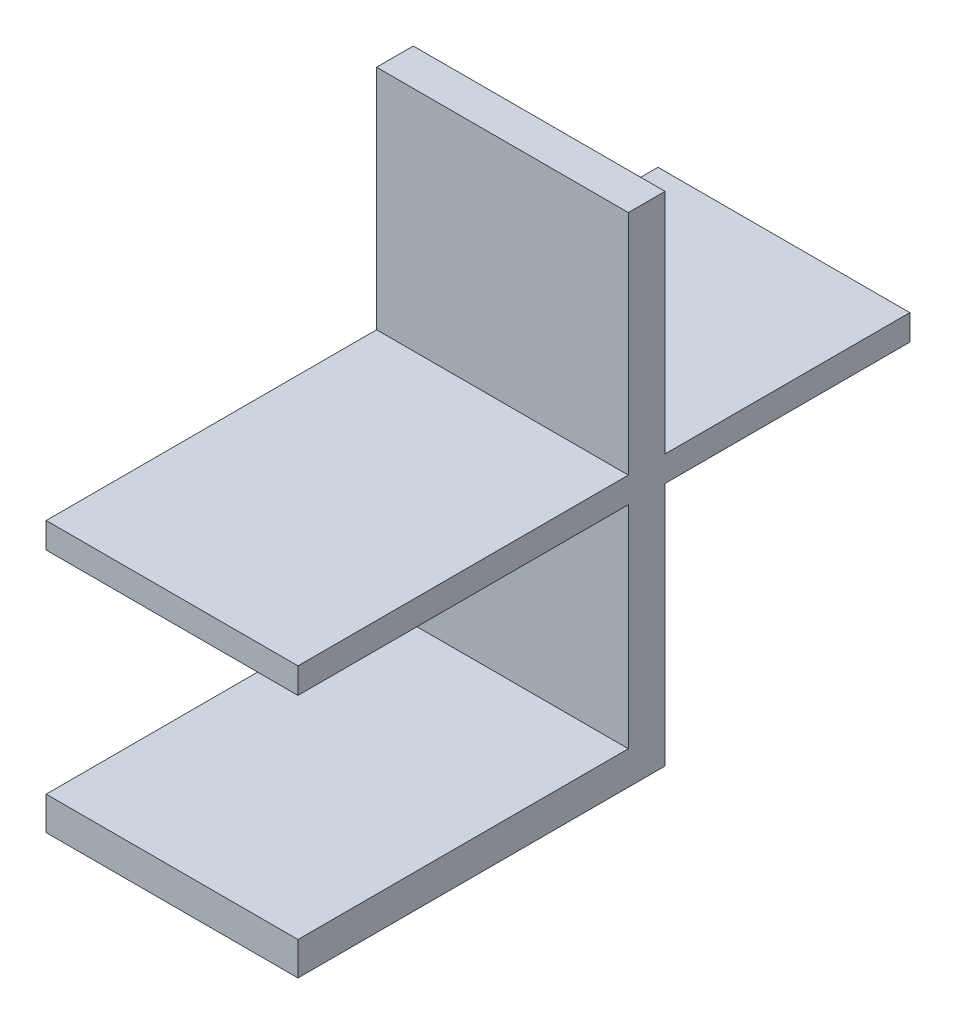
ISO-10303-21;
HEADER;
FILE_DESCRIPTION(('STEP AP214'),'2;1');
FILE_NAME('part.step','',(''),(''),'','','');
FILE_SCHEMA(('AUTOMOTIVE_DESIGN { 1 0 10303 214 1 1 1 1 }'));
ENDSEC;
DATA;
#1=APPLICATION_CONTEXT('core data for automotive mechanical design processes');
#2=APPLICATION_PROTOCOL_DEFINITION('international standard','automotive_design',2000,#1);
#3=PRODUCT_CONTEXT('',#1,'mechanical');
#4=PRODUCT('Part','Part','',(#3));
#5=PRODUCT_RELATED_PRODUCT_CATEGORY('part','',(#4));
#6=PRODUCT_DEFINITION_FORMATION('','',#4);
#7=PRODUCT_DEFINITION_CONTEXT('part definition',#1,'design');
#8=PRODUCT_DEFINITION('design','',#6,#7);
#9=PRODUCT_DEFINITION_SHAPE('','',#8);
#10=(LENGTH_UNIT() NAMED_UNIT(*) SI_UNIT(.MILLI.,.METRE.));
#11=(NAMED_UNIT(*) PLANE_ANGLE_UNIT() SI_UNIT($,.RADIAN.));
#12=(NAMED_UNIT(*) SI_UNIT($,.STERADIAN.) SOLID_ANGLE_UNIT());
#13=UNCERTAINTY_MEASURE_WITH_UNIT(LENGTH_MEASURE(1.E-05),#10,'distance_accuracy_value','');
#14=(GEOMETRIC_REPRESENTATION_CONTEXT(3) GLOBAL_UNCERTAINTY_ASSIGNED_CONTEXT((#13)) GLOBAL_UNIT_ASSIGNED_CONTEXT((#10,
#11,#12)) REPRESENTATION_CONTEXT('',''));
#15=CARTESIAN_POINT('',(0.,0.,0.));
#16=DIRECTION('',(0.,0.,1.));
#17=DIRECTION('',(1.,0.,0.));
#18=AXIS2_PLACEMENT_3D('',#15,#16,#17);
#19=CARTESIAN_POINT('',(90.3712111208343,5.53566649843251,198.567247699072));
#20=DIRECTION('',(0.,0.,-1.));
#21=DIRECTION('',(-1.,0.,0.));
#22=AXIS2_PLACEMENT_3D('',#19,#20,#21);
#23=PLANE('',#22);
#24=DIRECTION('',(-1.,0.,0.));
#25=VECTOR('',#24,1.);
#26=CARTESIAN_POINT('',(110.947514771984,8.25912695731414,198.567247699072));
#27=LINE('',#26,#25);
#28=CARTESIAN_POINT('',(110.947514771984,8.25912695731414,198.567247699072));
#29=VERTEX_POINT('',#28);
#30=CARTESIAN_POINT('',(90.3712111208343,8.25912695731414,198.567247699072));
#31=VERTEX_POINT('',#30);
#32=EDGE_CURVE('E154',#29,#31,#27,.T.);
#33=ORIENTED_EDGE('',*,*,#32,.F.);
#34=DIRECTION('',(0.,1.,0.));
#35=VECTOR('',#34,1.);
#36=CARTESIAN_POINT('',(110.947514771984,5.53566649843251,198.567247699072));
#37=LINE('',#36,#35);
#38=CARTESIAN_POINT('',(110.947514771984,25.5356664984325,198.567247699072));
#39=VERTEX_POINT('',#38);
#40=EDGE_CURVE('E159',#29,#39,#37,.T.);
#41=ORIENTED_EDGE('',*,*,#40,.T.);
#42=DIRECTION('',(-1.,0.,0.));
#43=VECTOR('',#42,1.);
#44=CARTESIAN_POINT('',(90.3712111208343,25.5356664984325,198.567247699072));
#45=LINE('',#44,#43);
#46=CARTESIAN_POINT('',(90.3712111208343,25.5356664984325,198.567247699072));
#47=VERTEX_POINT('',#46);
#48=EDGE_CURVE('E161',#39,#47,#45,.T.);
#49=ORIENTED_EDGE('',*,*,#48,.T.);
#50=DIRECTION('',(0.,1.,0.));
#51=VECTOR('',#50,1.);
#52=CARTESIAN_POINT('',(90.3712111208343,5.53566649843251,198.567247699072));
#53=LINE('',#52,#51);
#54=EDGE_CURVE('E49',#31,#47,#53,.T.);
#55=ORIENTED_EDGE('',*,*,#54,.F.);
#56=EDGE_LOOP('',(#33,#41,#49,#55));
#57=FACE_BOUND('',#56,.T.);
#58=ADVANCED_FACE('F32',(#57),#23,.F.);
#59=CARTESIAN_POINT('',(90.3712111208343,25.5356664984325,175.567247699072));
#60=DIRECTION('',(0.,-1.,0.));
#61=DIRECTION('',(0.,0.,-1.));
#62=AXIS2_PLACEMENT_3D('',#59,#60,#61);
#63=PLANE('',#62);
#64=ORIENTED_EDGE('',*,*,#48,.F.);
#65=DIRECTION('',(0.,0.,1.));
#66=VECTOR('',#65,1.);
#67=CARTESIAN_POINT('',(110.947514771984,25.5356664984325,175.567247699072));
#68=LINE('',#67,#66);
#69=CARTESIAN_POINT('',(110.947514771984,25.5356664984325,225.567247699072));
#70=VERTEX_POINT('',#69);
#71=EDGE_CURVE('E41',#39,#70,#68,.T.);
#72=ORIENTED_EDGE('',*,*,#71,.T.);
#73=DIRECTION('',(1.,0.,0.));
#74=VECTOR('',#73,1.);
#75=CARTESIAN_POINT('',(90.3712111208343,25.5356664984325,225.567247699072));
#76=LINE('',#75,#74);
#77=CARTESIAN_POINT('',(90.3712111208343,25.5356664984325,225.567247699072));
#78=VERTEX_POINT('',#77);
#79=EDGE_CURVE('E219',#78,#70,#76,.T.);
#80=ORIENTED_EDGE('',*,*,#79,.F.);
#81=DIRECTION('',(0.,0.,1.));
#82=VECTOR('',#81,1.);
#83=CARTESIAN_POINT('',(90.3712111208343,25.5356664984325,175.567247699072));
#84=LINE('',#83,#82);
#85=EDGE_CURVE('E236',#47,#78,#84,.T.);
#86=ORIENTED_EDGE('',*,*,#85,.F.);
#87=EDGE_LOOP('',(#64,#72,#80,#86));
#88=FACE_BOUND('',#87,.T.);
#89=ADVANCED_FACE('F254',(#88),#63,.T.);
#90=CARTESIAN_POINT('',(110.947514771984,27.626098268138,175.567247699072));
#91=DIRECTION('',(0.,1.,0.));
#92=DIRECTION('',(0.,0.,1.));
#93=AXIS2_PLACEMENT_3D('',#90,#91,#92);
#94=PLANE('',#93);
#95=DIRECTION('',(0.,0.,1.));
#96=VECTOR('',#95,1.);
#97=CARTESIAN_POINT('',(90.3712111208343,27.626098268138,175.567247699072));
#98=LINE('',#97,#96);
#99=CARTESIAN_POINT('',(90.3712111208343,27.626098268138,175.567247699072));
#100=VERTEX_POINT('',#99);
#101=CARTESIAN_POINT('',(90.3712111208343,27.626098268138,195.567247699072));
#102=VERTEX_POINT('',#101);
#103=EDGE_CURVE('E237',#100,#102,#98,.T.);
#104=ORIENTED_EDGE('',*,*,#103,.T.);
#105=DIRECTION('',(1.,0.,0.));
#106=VECTOR('',#105,1.);
#107=CARTESIAN_POINT('',(110.947514771984,27.626098268138,195.567247699072));
#108=LINE('',#107,#106);
#109=CARTESIAN_POINT('',(110.947514771984,27.626098268138,195.567247699072));
#110=VERTEX_POINT('',#109);
#111=EDGE_CURVE('E188',#102,#110,#108,.T.);
#112=ORIENTED_EDGE('',*,*,#111,.T.);
#113=DIRECTION('',(0.,0.,1.));
#114=VECTOR('',#113,1.);
#115=CARTESIAN_POINT('',(110.947514771984,27.626098268138,175.567247699072));
#116=LINE('',#115,#114);
#117=CARTESIAN_POINT('',(110.947514771984,27.626098268138,175.567247699072));
#118=VERTEX_POINT('',#117);
#119=EDGE_CURVE('E36',#118,#110,#116,.T.);
#120=ORIENTED_EDGE('',*,*,#119,.F.);
#121=DIRECTION('',(-1.,0.,0.));
#122=VECTOR('',#121,1.);
#123=CARTESIAN_POINT('',(110.947514771984,27.626098268138,175.567247699072));
#124=LINE('',#123,#122);
#125=EDGE_CURVE('E225',#118,#100,#124,.T.);
#126=ORIENTED_EDGE('',*,*,#125,.T.);
#127=EDGE_LOOP('',(#104,#112,#120,#126));
#128=FACE_BOUND('',#127,.T.);
#129=ADVANCED_FACE('F272',(#128),#94,.T.);
#130=CARTESIAN_POINT('',(110.947514771984,27.626098268138,175.567247699072));
#131=DIRECTION('',(1.,0.,0.));
#132=DIRECTION('',(0.,0.,-1.));
#133=AXIS2_PLACEMENT_3D('',#130,#131,#132);
#134=PLANE('',#133);
#135=ORIENTED_EDGE('',*,*,#119,.T.);
#136=DIRECTION('',(0.,1.,0.));
#137=VECTOR('',#136,1.);
#138=CARTESIAN_POINT('',(110.947514771984,27.626098268138,195.567247699072));
#139=LINE('',#138,#137);
#140=CARTESIAN_POINT('',(110.947514771984,46.2079762310838,195.567247699072));
#141=VERTEX_POINT('',#140);
#142=EDGE_CURVE('E183',#110,#141,#139,.T.);
#143=ORIENTED_EDGE('',*,*,#142,.T.);
#144=DIRECTION('',(0.,0.,-1.));
#145=VECTOR('',#144,1.);
#146=CARTESIAN_POINT('',(110.947514771984,46.2079762310838,198.567247699072));
#147=LINE('',#146,#145);
#148=CARTESIAN_POINT('',(110.947514771984,46.2079762310838,198.567247699072));
#149=VERTEX_POINT('',#148);
#150=EDGE_CURVE('E207',#149,#141,#147,.T.);
#151=ORIENTED_EDGE('',*,*,#150,.F.);
#152=DIRECTION('',(0.,1.,0.));
#153=VECTOR('',#152,1.);
#154=CARTESIAN_POINT('',(110.947514771984,27.626098268138,198.567247699072));
#155=LINE('',#154,#153);
#156=CARTESIAN_POINT('',(110.947514771984,27.626098268138,198.567247699072));
#157=VERTEX_POINT('',#156);
#158=EDGE_CURVE('E184',#157,#149,#155,.T.);
#159=ORIENTED_EDGE('',*,*,#158,.F.);
#160=CARTESIAN_POINT('',(110.947514771984,27.626098268138,225.567247699072));
#161=VERTEX_POINT('',#160);
#162=EDGE_CURVE('E233',#157,#161,#116,.T.);
#163=ORIENTED_EDGE('',*,*,#162,.T.);
#164=DIRECTION('',(0.,1.,0.));
#165=VECTOR('',#164,1.);
#166=CARTESIAN_POINT('',(110.947514771984,27.626098268138,225.567247699072));
#167=LINE('',#166,#165);
#168=EDGE_CURVE('E210',#70,#161,#167,.T.);
#169=ORIENTED_EDGE('',*,*,#168,.F.);
#170=ORIENTED_EDGE('',*,*,#71,.F.);
#171=ORIENTED_EDGE('',*,*,#40,.F.);
#172=DIRECTION('',(0.,0.,-1.));
#173=VECTOR('',#172,1.);
#174=CARTESIAN_POINT('',(110.947514771984,8.25912695731414,225.567247699072));
#175=LINE('',#174,#173);
#176=CARTESIAN_POINT('',(110.947514771984,8.25912695731414,225.567247699072));
#177=VERTEX_POINT('',#176);
#178=EDGE_CURVE('E138',#177,#29,#175,.T.);
#179=ORIENTED_EDGE('',*,*,#178,.F.);
#180=DIRECTION('',(0.,1.,0.));
#181=VECTOR('',#180,1.);
#182=CARTESIAN_POINT('',(110.947514771984,5.53566649843251,225.567247699072));
#183=LINE('',#182,#181);
#184=CARTESIAN_POINT('',(110.947514771984,5.53566649843251,225.567247699072));
#185=VERTEX_POINT('',#184);
#186=EDGE_CURVE('E145',#185,#177,#183,.T.);
#187=ORIENTED_EDGE('',*,*,#186,.F.);
#188=DIRECTION('',(0.,0.,1.));
#189=VECTOR('',#188,1.);
#190=CARTESIAN_POINT('',(110.947514771984,5.53566649843251,198.567247699072));
#191=LINE('',#190,#189);
#192=CARTESIAN_POINT('',(110.947514771984,5.53566649843251,195.567247699072));
#193=VERTEX_POINT('',#192);
#194=EDGE_CURVE('E171',#193,#185,#191,.T.);
#195=ORIENTED_EDGE('',*,*,#194,.F.);
#196=DIRECTION('',(0.,1.,0.));
#197=VECTOR('',#196,1.);
#198=CARTESIAN_POINT('',(110.947514771984,5.53566649843251,195.567247699072));
#199=LINE('',#198,#197);
#200=CARTESIAN_POINT('',(110.947514771984,25.5356664984325,195.567247699072));
#201=VERTEX_POINT('',#200);
#202=EDGE_CURVE('E177',#193,#201,#199,.T.);
#203=ORIENTED_EDGE('',*,*,#202,.T.);
#204=CARTESIAN_POINT('',(110.947514771984,25.5356664984325,175.567247699072));
#205=VERTEX_POINT('',#204);
#206=EDGE_CURVE('E11',#205,#201,#68,.T.);
#207=ORIENTED_EDGE('',*,*,#206,.F.);
#208=DIRECTION('',(0.,1.,0.));
#209=VECTOR('',#208,1.);
#210=CARTESIAN_POINT('',(110.947514771984,27.626098268138,175.567247699072));
#211=LINE('',#210,#209);
#212=EDGE_CURVE('E222',#205,#118,#211,.T.);
#213=ORIENTED_EDGE('',*,*,#212,.T.);
#214=EDGE_LOOP('',(#135,#143,#151,#159,#163,#169,#170,#171,#179,#187,#195,#203,#207,#213));
#215=FACE_BOUND('',#214,.T.);
#216=ADVANCED_FACE('F34',(#215),#134,.T.);
#217=DIRECTION('',(1.,0.,0.));
#218=VECTOR('',#217,1.);
#219=CARTESIAN_POINT('',(110.947514771984,25.5356664984325,195.567247699072));
#220=LINE('',#219,#218);
#221=CARTESIAN_POINT('',(90.3712111208343,25.5356664984325,195.567247699072));
#222=VERTEX_POINT('',#221);
#223=EDGE_CURVE('E56',#222,#201,#220,.T.);
#224=ORIENTED_EDGE('',*,*,#223,.F.);
#225=CARTESIAN_POINT('',(90.3712111208343,25.5356664984325,175.567247699072));
#226=VERTEX_POINT('',#225);
#227=EDGE_CURVE('E235',#226,#222,#84,.T.);
#228=ORIENTED_EDGE('',*,*,#227,.F.);
#229=DIRECTION('',(1.,0.,0.));
#230=VECTOR('',#229,1.);
#231=CARTESIAN_POINT('',(90.3712111208343,25.5356664984325,175.567247699072));
#232=LINE('',#231,#230);
#233=EDGE_CURVE('E231',#226,#205,#232,.T.);
#234=ORIENTED_EDGE('',*,*,#233,.T.);
#235=ORIENTED_EDGE('',*,*,#206,.T.);
#236=EDGE_LOOP('',(#224,#228,#234,#235));
#237=FACE_BOUND('',#236,.T.);
#238=ADVANCED_FACE('F268',(#237),#63,.T.);
#239=CARTESIAN_POINT('',(90.3712111208343,27.626098268138,175.567247699072));
#240=DIRECTION('',(-1.,0.,0.));
#241=DIRECTION('',(0.,0.,1.));
#242=AXIS2_PLACEMENT_3D('',#239,#240,#241);
#243=PLANE('',#242);
#244=ORIENTED_EDGE('',*,*,#227,.T.);
#245=DIRECTION('',(0.,1.,0.));
#246=VECTOR('',#245,1.);
#247=CARTESIAN_POINT('',(90.3712111208343,5.53566649843251,195.567247699072));
#248=LINE('',#247,#246);
#249=CARTESIAN_POINT('',(90.3712111208343,5.53566649843251,195.567247699072));
#250=VERTEX_POINT('',#249);
#251=EDGE_CURVE('E180',#250,#222,#248,.T.);
#252=ORIENTED_EDGE('',*,*,#251,.F.);
#253=DIRECTION('',(0.,0.,-1.));
#254=VECTOR('',#253,1.);
#255=CARTESIAN_POINT('',(90.3712111208343,5.53566649843251,198.567247699072));
#256=LINE('',#255,#254);
#257=CARTESIAN_POINT('',(90.3712111208343,5.53566649843251,225.567247699072));
#258=VERTEX_POINT('',#257);
#259=EDGE_CURVE('E166',#258,#250,#256,.T.);
#260=ORIENTED_EDGE('',*,*,#259,.F.);
#261=DIRECTION('',(0.,-1.,0.));
#262=VECTOR('',#261,1.);
#263=CARTESIAN_POINT('',(90.3712111208343,5.53566649843251,225.567247699072));
#264=LINE('',#263,#262);
#265=CARTESIAN_POINT('',(90.3712111208343,8.25912695731414,225.567247699072));
#266=VERTEX_POINT('',#265);
#267=EDGE_CURVE('E144',#266,#258,#264,.T.);
#268=ORIENTED_EDGE('',*,*,#267,.F.);
#269=DIRECTION('',(0.,0.,-1.));
#270=VECTOR('',#269,1.);
#271=CARTESIAN_POINT('',(90.3712111208343,8.25912695731414,225.567247699072));
#272=LINE('',#271,#270);
#273=EDGE_CURVE('E140',#266,#31,#272,.T.);
#274=ORIENTED_EDGE('',*,*,#273,.T.);
#275=ORIENTED_EDGE('',*,*,#54,.T.);
#276=ORIENTED_EDGE('',*,*,#85,.T.);
#277=DIRECTION('',(0.,-1.,0.));
#278=VECTOR('',#277,1.);
#279=CARTESIAN_POINT('',(90.3712111208343,27.626098268138,225.567247699072));
#280=LINE('',#279,#278);
#281=CARTESIAN_POINT('',(90.3712111208343,27.626098268138,225.567247699072));
#282=VERTEX_POINT('',#281);
#283=EDGE_CURVE('E216',#282,#78,#280,.T.);
#284=ORIENTED_EDGE('',*,*,#283,.F.);
#285=CARTESIAN_POINT('',(90.3712111208343,27.626098268138,198.567247699072));
#286=VERTEX_POINT('',#285);
#287=EDGE_CURVE('E238',#286,#282,#98,.T.);
#288=ORIENTED_EDGE('',*,*,#287,.F.);
#289=DIRECTION('',(0.,-1.,0.));
#290=VECTOR('',#289,1.);
#291=CARTESIAN_POINT('',(90.3712111208343,27.626098268138,198.567247699072));
#292=LINE('',#291,#290);
#293=CARTESIAN_POINT('',(90.3712111208343,46.2079762310838,198.567247699072));
#294=VERTEX_POINT('',#293);
#295=EDGE_CURVE('E190',#294,#286,#292,.T.);
#296=ORIENTED_EDGE('',*,*,#295,.F.);
#297=DIRECTION('',(0.,0.,-1.));
#298=VECTOR('',#297,1.);
#299=CARTESIAN_POINT('',(90.3712111208343,46.2079762310838,198.567247699072));
#300=LINE('',#299,#298);
#301=CARTESIAN_POINT('',(90.3712111208343,46.2079762310838,195.567247699072));
#302=VERTEX_POINT('',#301);
#303=EDGE_CURVE('E196',#294,#302,#300,.T.);
#304=ORIENTED_EDGE('',*,*,#303,.T.);
#305=DIRECTION('',(0.,-1.,0.));
#306=VECTOR('',#305,1.);
#307=CARTESIAN_POINT('',(90.3712111208343,27.626098268138,195.567247699072));
#308=LINE('',#307,#306);
#309=EDGE_CURVE('E201',#302,#102,#308,.T.);
#310=ORIENTED_EDGE('',*,*,#309,.T.);
#311=ORIENTED_EDGE('',*,*,#103,.F.);
#312=DIRECTION('',(0.,-1.,0.));
#313=VECTOR('',#312,1.);
#314=CARTESIAN_POINT('',(90.3712111208343,27.626098268138,175.567247699072));
#315=LINE('',#314,#313);
#316=EDGE_CURVE('E228',#100,#226,#315,.T.);
#317=ORIENTED_EDGE('',*,*,#316,.T.);
#318=EDGE_LOOP('',(#244,#252,#260,#268,#274,#275,#276,#284,#288,#296,#304,#310,#311,#317));
#319=FACE_BOUND('',#318,.T.);
#320=ADVANCED_FACE('F265',(#319),#243,.T.);
#321=DIRECTION('',(1.,0.,0.));
#322=VECTOR('',#321,1.);
#323=CARTESIAN_POINT('',(110.947514771984,27.626098268138,198.567247699072));
#324=LINE('',#323,#322);
#325=EDGE_CURVE('E193',#286,#157,#324,.T.);
#326=ORIENTED_EDGE('',*,*,#325,.F.);
#327=ORIENTED_EDGE('',*,*,#287,.T.);
#328=DIRECTION('',(-1.,0.,0.));
#329=VECTOR('',#328,1.);
#330=CARTESIAN_POINT('',(110.947514771984,27.626098268138,225.567247699072));
#331=LINE('',#330,#329);
#332=EDGE_CURVE('E213',#161,#282,#331,.T.);
#333=ORIENTED_EDGE('',*,*,#332,.F.);
#334=ORIENTED_EDGE('',*,*,#162,.F.);
#335=EDGE_LOOP('',(#326,#327,#333,#334));
#336=FACE_BOUND('',#335,.T.);
#337=ADVANCED_FACE('F247',(#336),#94,.T.);
#338=CARTESIAN_POINT('',(0.,0.,175.567247699072));
#339=DIRECTION('',(0.,0.,1.));
#340=DIRECTION('',(1.,0.,0.));
#341=AXIS2_PLACEMENT_3D('',#338,#339,#340);
#342=PLANE('',#341);
#343=ORIENTED_EDGE('',*,*,#212,.F.);
#344=ORIENTED_EDGE('',*,*,#233,.F.);
#345=ORIENTED_EDGE('',*,*,#316,.F.);
#346=ORIENTED_EDGE('',*,*,#125,.F.);
#347=EDGE_LOOP('',(#343,#344,#345,#346));
#348=FACE_BOUND('',#347,.T.);
#349=ADVANCED_FACE('F270',(#348),#342,.F.);
#350=CARTESIAN_POINT('',(0.,0.,225.567247699072));
#351=DIRECTION('',(0.,0.,1.));
#352=DIRECTION('',(1.,0.,0.));
#353=AXIS2_PLACEMENT_3D('',#350,#351,#352);
#354=PLANE('',#353);
#355=ORIENTED_EDGE('',*,*,#168,.T.);
#356=ORIENTED_EDGE('',*,*,#332,.T.);
#357=ORIENTED_EDGE('',*,*,#283,.T.);
#358=ORIENTED_EDGE('',*,*,#79,.T.);
#359=EDGE_LOOP('',(#355,#356,#357,#358));
#360=FACE_BOUND('',#359,.T.);
#361=ADVANCED_FACE('F250',(#360),#354,.T.);
#362=CARTESIAN_POINT('',(110.947514771984,46.2079762310838,198.567247699072));
#363=DIRECTION('',(0.,-1.,0.));
#364=DIRECTION('',(0.,0.,-1.));
#365=AXIS2_PLACEMENT_3D('',#362,#363,#364);
#366=PLANE('',#365);
#367=DIRECTION('',(-1.,0.,0.));
#368=VECTOR('',#367,1.);
#369=CARTESIAN_POINT('',(110.947514771984,46.2079762310838,195.567247699072));
#370=LINE('',#369,#368);
#371=EDGE_CURVE('E199',#141,#302,#370,.T.);
#372=ORIENTED_EDGE('',*,*,#371,.T.);
#373=ORIENTED_EDGE('',*,*,#303,.F.);
#374=DIRECTION('',(-1.,0.,0.));
#375=VECTOR('',#374,1.);
#376=CARTESIAN_POINT('',(110.947514771984,46.2079762310838,198.567247699072));
#377=LINE('',#376,#375);
#378=EDGE_CURVE('E187',#149,#294,#377,.T.);
#379=ORIENTED_EDGE('',*,*,#378,.F.);
#380=ORIENTED_EDGE('',*,*,#150,.T.);
#381=EDGE_LOOP('',(#372,#373,#379,#380));
#382=FACE_BOUND('',#381,.T.);
#383=ADVANCED_FACE('F278',(#382),#366,.F.);
#384=CARTESIAN_POINT('',(0.,0.,198.567247699072));
#385=DIRECTION('',(0.,0.,1.));
#386=DIRECTION('',(1.,0.,0.));
#387=AXIS2_PLACEMENT_3D('',#384,#385,#386);
#388=PLANE('',#387);
#389=ORIENTED_EDGE('',*,*,#158,.T.);
#390=ORIENTED_EDGE('',*,*,#378,.T.);
#391=ORIENTED_EDGE('',*,*,#295,.T.);
#392=ORIENTED_EDGE('',*,*,#325,.T.);
#393=EDGE_LOOP('',(#389,#390,#391,#392));
#394=FACE_BOUND('',#393,.T.);
#395=ADVANCED_FACE('F282',(#394),#388,.T.);
#396=CARTESIAN_POINT('',(0.,0.,195.567247699072));
#397=DIRECTION('',(0.,0.,1.));
#398=DIRECTION('',(1.,0.,0.));
#399=AXIS2_PLACEMENT_3D('',#396,#397,#398);
#400=PLANE('',#399);
#401=ORIENTED_EDGE('',*,*,#142,.F.);
#402=ORIENTED_EDGE('',*,*,#111,.F.);
#403=ORIENTED_EDGE('',*,*,#309,.F.);
#404=ORIENTED_EDGE('',*,*,#371,.F.);
#405=EDGE_LOOP('',(#401,#402,#403,#404));
#406=FACE_BOUND('',#405,.T.);
#407=ADVANCED_FACE('F276',(#406),#400,.F.);
#408=CARTESIAN_POINT('',(110.947514771984,5.53566649843251,195.567247699072));
#409=DIRECTION('',(0.,0.,1.));
#410=DIRECTION('',(1.,0.,0.));
#411=AXIS2_PLACEMENT_3D('',#408,#409,#410);
#412=PLANE('',#411);
#413=ORIENTED_EDGE('',*,*,#223,.T.);
#414=ORIENTED_EDGE('',*,*,#202,.F.);
#415=DIRECTION('',(1.,0.,0.));
#416=VECTOR('',#415,1.);
#417=CARTESIAN_POINT('',(110.947514771984,5.53566649843251,195.567247699072));
#418=LINE('',#417,#416);
#419=EDGE_CURVE('E169',#250,#193,#418,.T.);
#420=ORIENTED_EDGE('',*,*,#419,.F.);
#421=ORIENTED_EDGE('',*,*,#251,.T.);
#422=EDGE_LOOP('',(#413,#414,#420,#421));
#423=FACE_BOUND('',#422,.T.);
#424=ADVANCED_FACE('F264',(#423),#412,.F.);
#425=CARTESIAN_POINT('',(0.,5.53566649843251,0.));
#426=DIRECTION('',(0.,1.,0.));
#427=DIRECTION('',(0.,0.,1.));
#428=AXIS2_PLACEMENT_3D('',#425,#426,#427);
#429=PLANE('',#428);
#430=ORIENTED_EDGE('',*,*,#259,.T.);
#431=ORIENTED_EDGE('',*,*,#419,.T.);
#432=ORIENTED_EDGE('',*,*,#194,.T.);
#433=DIRECTION('',(1.,0.,0.));
#434=VECTOR('',#433,1.);
#435=CARTESIAN_POINT('',(110.947514771984,5.53566649843251,225.567247699072));
#436=LINE('',#435,#434);
#437=EDGE_CURVE('E151',#258,#185,#436,.T.);
#438=ORIENTED_EDGE('',*,*,#437,.F.);
#439=EDGE_LOOP('',(#430,#431,#432,#438));
#440=FACE_BOUND('',#439,.T.);
#441=ADVANCED_FACE('F259',(#440),#429,.F.);
#442=CARTESIAN_POINT('',(110.947514771984,8.25912695731414,225.567247699072));
#443=DIRECTION('',(0.,-1.,0.));
#444=DIRECTION('',(0.,0.,-1.));
#445=AXIS2_PLACEMENT_3D('',#442,#443,#444);
#446=PLANE('',#445);
#447=ORIENTED_EDGE('',*,*,#32,.T.);
#448=ORIENTED_EDGE('',*,*,#273,.F.);
#449=DIRECTION('',(-1.,0.,0.));
#450=VECTOR('',#449,1.);
#451=CARTESIAN_POINT('',(110.947514771984,8.25912695731414,225.567247699072));
#452=LINE('',#451,#450);
#453=EDGE_CURVE('E134',#177,#266,#452,.T.);
#454=ORIENTED_EDGE('',*,*,#453,.F.);
#455=ORIENTED_EDGE('',*,*,#178,.T.);
#456=EDGE_LOOP('',(#447,#448,#454,#455));
#457=FACE_BOUND('',#456,.T.);
#458=ADVANCED_FACE('F136',(#457),#446,.F.);
#459=CARTESIAN_POINT('',(0.,0.,225.567247699072));
#460=DIRECTION('',(0.,0.,1.));
#461=DIRECTION('',(1.,0.,0.));
#462=AXIS2_PLACEMENT_3D('',#459,#460,#461);
#463=PLANE('',#462);
#464=ORIENTED_EDGE('',*,*,#186,.T.);
#465=ORIENTED_EDGE('',*,*,#453,.T.);
#466=ORIENTED_EDGE('',*,*,#267,.T.);
#467=ORIENTED_EDGE('',*,*,#437,.T.);
#468=EDGE_LOOP('',(#464,#465,#466,#467));
#469=FACE_BOUND('',#468,.T.);
#470=ADVANCED_FACE('F149',(#469),#463,.T.);
#471=CLOSED_SHELL('',(#58,#89,#129,#216,#238,#320,#337,#349,#361,#383,#395,#407,#424,#441,#458,#470));
#472=MANIFOLD_SOLID_BREP('B2',#471);
#473=ADVANCED_BREP_SHAPE_REPRESENTATION('',(#18,#472),#14);
#474=SHAPE_DEFINITION_REPRESENTATION(#9,#473);
ENDSEC;
END-ISO-10303-21;
